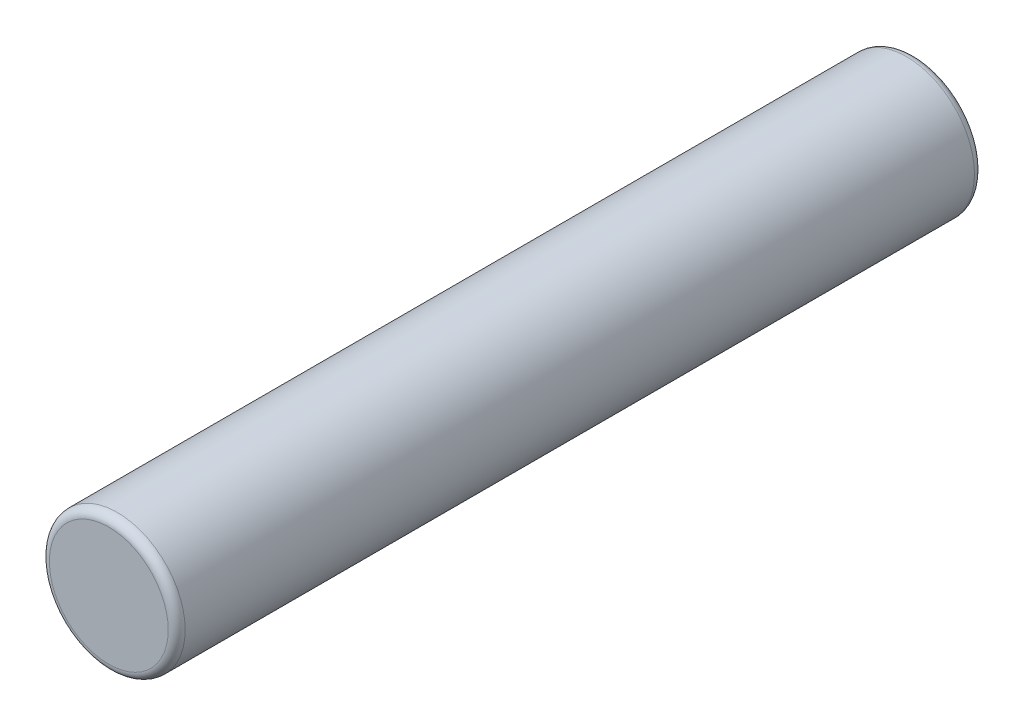
ISO-10303-21;
HEADER;
FILE_DESCRIPTION(('STEP AP214'),'2;1');
FILE_NAME('part.step','',(''),(''),'','','');
FILE_SCHEMA(('AUTOMOTIVE_DESIGN { 1 0 10303 214 1 1 1 1 }'));
ENDSEC;
DATA;
#1=APPLICATION_CONTEXT('core data for automotive mechanical design processes');
#2=APPLICATION_PROTOCOL_DEFINITION('international standard','automotive_design',2000,#1);
#3=PRODUCT_CONTEXT('',#1,'mechanical');
#4=PRODUCT('Part','Part','',(#3));
#5=PRODUCT_RELATED_PRODUCT_CATEGORY('part','',(#4));
#6=PRODUCT_DEFINITION_FORMATION('','',#4);
#7=PRODUCT_DEFINITION_CONTEXT('part definition',#1,'design');
#8=PRODUCT_DEFINITION('design','',#6,#7);
#9=PRODUCT_DEFINITION_SHAPE('','',#8);
#10=(LENGTH_UNIT() NAMED_UNIT(*) SI_UNIT(.MILLI.,.METRE.));
#11=(NAMED_UNIT(*) PLANE_ANGLE_UNIT() SI_UNIT($,.RADIAN.));
#12=(NAMED_UNIT(*) SI_UNIT($,.STERADIAN.) SOLID_ANGLE_UNIT());
#13=UNCERTAINTY_MEASURE_WITH_UNIT(LENGTH_MEASURE(1.E-05),#10,'distance_accuracy_value','');
#14=(GEOMETRIC_REPRESENTATION_CONTEXT(3) GLOBAL_UNCERTAINTY_ASSIGNED_CONTEXT((#13)) GLOBAL_UNIT_ASSIGNED_CONTEXT((#10,
#11,#12)) REPRESENTATION_CONTEXT('',''));
#15=CARTESIAN_POINT('',(0.,0.,0.));
#16=DIRECTION('',(0.,0.,1.));
#17=DIRECTION('',(1.,0.,0.));
#18=AXIS2_PLACEMENT_3D('',#15,#16,#17);
#19=CARTESIAN_POINT('',(0.,0.,9.5));
#20=DIRECTION('',(0.,0.,-1.));
#21=DIRECTION('',(-1.,0.,0.));
#22=AXIS2_PLACEMENT_3D('',#19,#20,#21);
#23=CYLINDRICAL_SURFACE('',#22,0.8);
#24=CARTESIAN_POINT('',(0.,0.,0.0999999999999994));
#25=DIRECTION('',(0.,0.,1.));
#26=DIRECTION('',(1.,0.,0.));
#27=AXIS2_PLACEMENT_3D('',#24,#25,#26);
#28=CIRCLE('',#27,0.8);
#29=CARTESIAN_POINT('',(0.8,0.,0.0999999999999994));
#30=VERTEX_POINT('',#29);
#31=EDGE_CURVE('E42',#30,#30,#28,.T.);
#32=ORIENTED_EDGE('',*,*,#31,.T.);
#33=EDGE_LOOP('',(#32));
#34=FACE_BOUND('',#33,.T.);
#35=CARTESIAN_POINT('',(0.,0.,9.4));
#36=DIRECTION('',(0.,0.,1.));
#37=DIRECTION('',(1.,0.,0.));
#38=AXIS2_PLACEMENT_3D('',#35,#36,#37);
#39=CIRCLE('',#38,0.8);
#40=CARTESIAN_POINT('',(0.8,0.,9.4));
#41=VERTEX_POINT('',#40);
#42=EDGE_CURVE('E46',#41,#41,#39,.F.);
#43=ORIENTED_EDGE('',*,*,#42,.T.);
#44=EDGE_LOOP('',(#43));
#45=FACE_BOUND('',#44,.T.);
#46=ADVANCED_FACE('F31',(#34,#45),#23,.T.);
#47=CARTESIAN_POINT('',(0.,0.,9.5));
#48=DIRECTION('',(0.,0.,1.));
#49=DIRECTION('',(1.,0.,0.));
#50=AXIS2_PLACEMENT_3D('',#47,#48,#49);
#51=PLANE('',#50);
#52=CARTESIAN_POINT('',(0.,0.,9.5));
#53=DIRECTION('',(0.,0.,1.));
#54=DIRECTION('',(1.,0.,0.));
#55=AXIS2_PLACEMENT_3D('',#52,#53,#54);
#56=CIRCLE('',#55,0.7);
#57=CARTESIAN_POINT('',(0.7,0.,9.5));
#58=VERTEX_POINT('',#57);
#59=EDGE_CURVE('E10',#58,#58,#56,.T.);
#60=ORIENTED_EDGE('',*,*,#59,.T.);
#61=EDGE_LOOP('',(#60));
#62=FACE_BOUND('',#61,.T.);
#63=ADVANCED_FACE('F62',(#62),#51,.T.);
#64=CARTESIAN_POINT('',(0.,0.,0.));
#65=DIRECTION('',(0.,0.,1.));
#66=DIRECTION('',(1.,0.,0.));
#67=AXIS2_PLACEMENT_3D('',#64,#65,#66);
#68=PLANE('',#67);
#69=CARTESIAN_POINT('',(0.,0.,0.));
#70=DIRECTION('',(0.,0.,1.));
#71=DIRECTION('',(1.,0.,0.));
#72=AXIS2_PLACEMENT_3D('',#69,#70,#71);
#73=CIRCLE('',#72,0.7);
#74=CARTESIAN_POINT('',(0.7,0.,0.));
#75=VERTEX_POINT('',#74);
#76=EDGE_CURVE('E38',#75,#75,#73,.F.);
#77=ORIENTED_EDGE('',*,*,#76,.T.);
#78=EDGE_LOOP('',(#77));
#79=FACE_BOUND('',#78,.T.);
#80=ADVANCED_FACE('F59',(#79),#68,.F.);
#81=CARTESIAN_POINT('',(0.,0.,0.0999999999999994));
#82=DIRECTION('',(0.,0.,1.));
#83=DIRECTION('',(1.,0.,0.));
#84=AXIS2_PLACEMENT_3D('',#81,#82,#83);
#85=TOROIDAL_SURFACE('',#84,0.7,0.1);
#86=ORIENTED_EDGE('',*,*,#76,.F.);
#87=EDGE_LOOP('',(#86));
#88=FACE_BOUND('',#87,.T.);
#89=ORIENTED_EDGE('',*,*,#31,.F.);
#90=EDGE_LOOP('',(#89));
#91=FACE_BOUND('',#90,.T.);
#92=ADVANCED_FACE('F55',(#88,#91),#85,.T.);
#93=CARTESIAN_POINT('',(0.,0.,9.4));
#94=DIRECTION('',(0.,0.,1.));
#95=DIRECTION('',(1.,0.,0.));
#96=AXIS2_PLACEMENT_3D('',#93,#94,#95);
#97=TOROIDAL_SURFACE('',#96,0.7,0.1);
#98=ORIENTED_EDGE('',*,*,#42,.F.);
#99=EDGE_LOOP('',(#98));
#100=FACE_BOUND('',#99,.T.);
#101=ORIENTED_EDGE('',*,*,#59,.F.);
#102=EDGE_LOOP('',(#101));
#103=FACE_BOUND('',#102,.T.);
#104=ADVANCED_FACE('F33',(#100,#103),#97,.T.);
#105=CLOSED_SHELL('',(#46,#63,#80,#92,#104));
#106=MANIFOLD_SOLID_BREP('B2',#105);
#107=ADVANCED_BREP_SHAPE_REPRESENTATION('',(#18,#106),#14);
#108=SHAPE_DEFINITION_REPRESENTATION(#9,#107);
ENDSEC;
END-ISO-10303-21;
